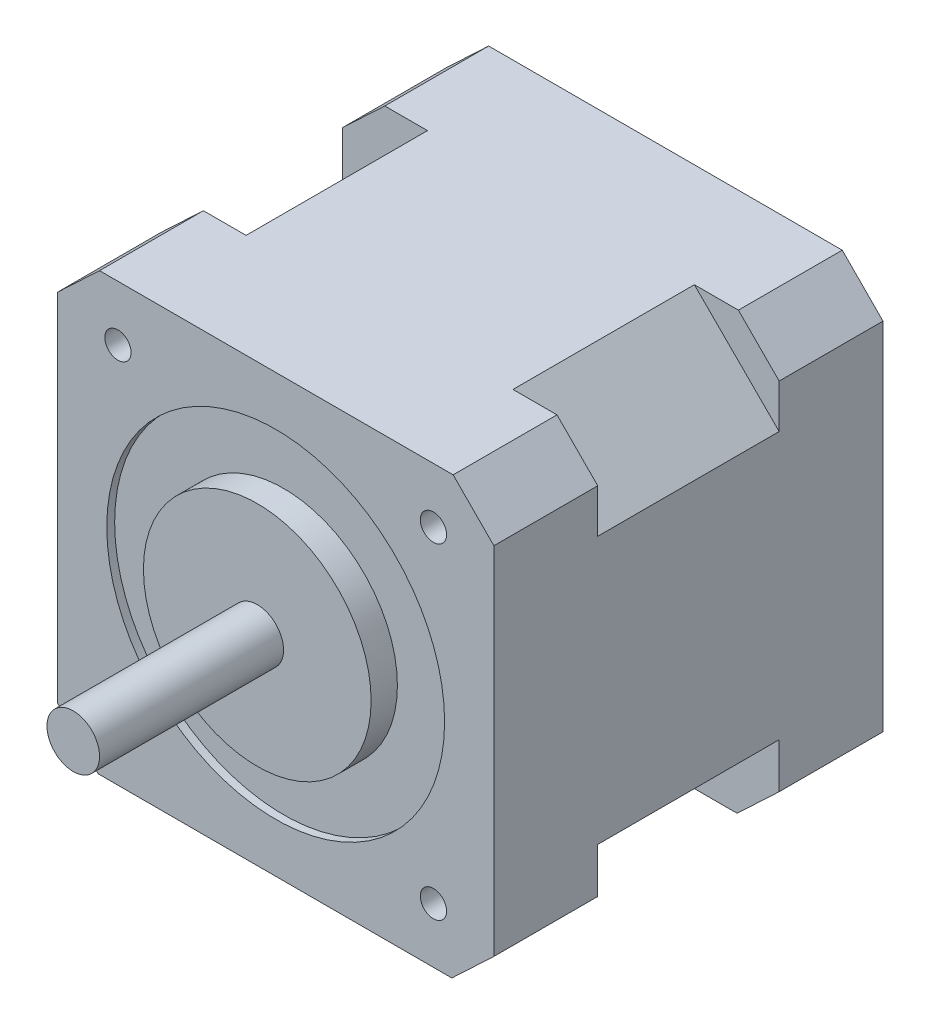
ISO-10303-21;
HEADER;
FILE_DESCRIPTION(('STEP AP214'),'2;1');
FILE_NAME('part.step','',(''),(''),'','','');
FILE_SCHEMA(('AUTOMOTIVE_DESIGN { 1 0 10303 214 1 1 1 1 }'));
ENDSEC;
DATA;
#1=APPLICATION_CONTEXT('core data for automotive mechanical design processes');
#2=APPLICATION_PROTOCOL_DEFINITION('international standard','automotive_design',2000,#1);
#3=PRODUCT_CONTEXT('',#1,'mechanical');
#4=PRODUCT('Part','Part','',(#3));
#5=PRODUCT_RELATED_PRODUCT_CATEGORY('part','',(#4));
#6=PRODUCT_DEFINITION_FORMATION('','',#4);
#7=PRODUCT_DEFINITION_CONTEXT('part definition',#1,'design');
#8=PRODUCT_DEFINITION('design','',#6,#7);
#9=PRODUCT_DEFINITION_SHAPE('','',#8);
#10=(LENGTH_UNIT() NAMED_UNIT(*) SI_UNIT(.MILLI.,.METRE.));
#11=(NAMED_UNIT(*) PLANE_ANGLE_UNIT() SI_UNIT($,.RADIAN.));
#12=(NAMED_UNIT(*) SI_UNIT($,.STERADIAN.) SOLID_ANGLE_UNIT());
#13=UNCERTAINTY_MEASURE_WITH_UNIT(LENGTH_MEASURE(1.E-05),#10,'distance_accuracy_value','');
#14=(GEOMETRIC_REPRESENTATION_CONTEXT(3) GLOBAL_UNCERTAINTY_ASSIGNED_CONTEXT((#13)) GLOBAL_UNIT_ASSIGNED_CONTEXT((#10,
#11,#12)) REPRESENTATION_CONTEXT('',''));
#15=CARTESIAN_POINT('',(0.,0.,0.));
#16=DIRECTION('',(0.,0.,1.));
#17=DIRECTION('',(1.,0.,0.));
#18=AXIS2_PLACEMENT_3D('',#15,#16,#17);
#19=CARTESIAN_POINT('',(0.,0.,-10.033));
#20=DIRECTION('',(0.,0.,-1.));
#21=DIRECTION('',(-1.,0.,0.));
#22=AXIS2_PLACEMENT_3D('',#19,#20,#21);
#23=PLANE('',#22);
#24=DIRECTION('',(0.707106781186547,-0.707106781186548,0.));
#25=VECTOR('',#24,1.);
#26=CARTESIAN_POINT('',(21.082,12.8920064176102,-10.033));
#27=LINE('',#26,#25);
#28=CARTESIAN_POINT('',(12.8920064176102,21.082,-10.033));
#29=VERTEX_POINT('',#28);
#30=CARTESIAN_POINT('',(21.082,12.8920064176102,-10.033));
#31=VERTEX_POINT('',#30);
#32=EDGE_CURVE('E315',#29,#31,#27,.T.);
#33=ORIENTED_EDGE('',*,*,#32,.F.);
#34=DIRECTION('',(-1.,0.,0.));
#35=VECTOR('',#34,1.);
#36=CARTESIAN_POINT('',(-17.018,21.082,-10.033));
#37=LINE('',#36,#35);
#38=CARTESIAN_POINT('',(17.145,21.082,-10.033));
#39=VERTEX_POINT('',#38);
#40=EDGE_CURVE('E337',#39,#29,#37,.T.);
#41=ORIENTED_EDGE('',*,*,#40,.F.);
#42=DIRECTION('',(-0.704545454545454,0.709658863454364,0.));
#43=VECTOR('',#42,1.);
#44=CARTESIAN_POINT('',(17.145,21.082,-10.033));
#45=LINE('',#44,#43);
#46=CARTESIAN_POINT('',(21.082,17.116426271017,-10.033));
#47=VERTEX_POINT('',#46);
#48=EDGE_CURVE('E342',#47,#39,#45,.T.);
#49=ORIENTED_EDGE('',*,*,#48,.F.);
#50=DIRECTION('',(0.,1.,0.));
#51=VECTOR('',#50,1.);
#52=CARTESIAN_POINT('',(21.082,17.116426271017,-10.033));
#53=LINE('',#52,#51);
#54=EDGE_CURVE('E388',#31,#47,#53,.T.);
#55=ORIENTED_EDGE('',*,*,#54,.F.);
#56=EDGE_LOOP('',(#33,#41,#49,#55));
#57=FACE_BOUND('',#56,.T.);
#58=ADVANCED_FACE('F37',(#57),#23,.T.);
#59=DIRECTION('',(0.707106781186548,0.707106781186547,0.));
#60=VECTOR('',#59,1.);
#61=CARTESIAN_POINT('',(-12.8920064176102,21.082,-10.033));
#62=LINE('',#61,#60);
#63=CARTESIAN_POINT('',(-21.082,12.8920064176102,-10.033));
#64=VERTEX_POINT('',#63);
#65=CARTESIAN_POINT('',(-12.8920064176102,21.082,-10.033));
#66=VERTEX_POINT('',#65);
#67=EDGE_CURVE('E321',#64,#66,#62,.T.);
#68=ORIENTED_EDGE('',*,*,#67,.F.);
#69=DIRECTION('',(0.,-1.,0.));
#70=VECTOR('',#69,1.);
#71=CARTESIAN_POINT('',(-21.082,17.2466841068825,-10.033));
#72=LINE('',#71,#70);
#73=CARTESIAN_POINT('',(-21.082,17.2466841068825,-10.033));
#74=VERTEX_POINT('',#73);
#75=EDGE_CURVE('E411',#74,#64,#72,.T.);
#76=ORIENTED_EDGE('',*,*,#75,.F.);
#77=DIRECTION('',(-0.727272727272727,-0.686348585024614,0.));
#78=VECTOR('',#77,1.);
#79=CARTESIAN_POINT('',(-21.082,17.2466841068825,-10.033));
#80=LINE('',#79,#78);
#81=CARTESIAN_POINT('',(-17.018,21.082,-10.033));
#82=VERTEX_POINT('',#81);
#83=EDGE_CURVE('E331',#82,#74,#80,.T.);
#84=ORIENTED_EDGE('',*,*,#83,.F.);
#85=EDGE_CURVE('E334',#66,#82,#37,.T.);
#86=ORIENTED_EDGE('',*,*,#85,.F.);
#87=EDGE_LOOP('',(#68,#76,#84,#86));
#88=FACE_BOUND('',#87,.T.);
#89=ADVANCED_FACE('F430',(#88),#23,.T.);
#90=DIRECTION('',(-0.707106781186548,0.707106781186548,0.));
#91=VECTOR('',#90,1.);
#92=CARTESIAN_POINT('',(-21.082,-12.8920064176102,-10.033));
#93=LINE('',#92,#91);
#94=CARTESIAN_POINT('',(-12.8920064176102,-21.082,-10.033));
#95=VERTEX_POINT('',#94);
#96=CARTESIAN_POINT('',(-21.082,-12.8920064176102,-10.033));
#97=VERTEX_POINT('',#96);
#98=EDGE_CURVE('E294',#95,#97,#93,.T.);
#99=ORIENTED_EDGE('',*,*,#98,.F.);
#100=DIRECTION('',(1.,0.,0.));
#101=VECTOR('',#100,1.);
#102=CARTESIAN_POINT('',(-17.145,-21.082,-10.033));
#103=LINE('',#102,#101);
#104=CARTESIAN_POINT('',(-17.145,-21.082,-10.033));
#105=VERTEX_POINT('',#104);
#106=EDGE_CURVE('E396',#105,#95,#103,.T.);
#107=ORIENTED_EDGE('',*,*,#106,.F.);
#108=DIRECTION('',(0.704545454545455,-0.709658863454363,0.));
#109=VECTOR('',#108,1.);
#110=CARTESIAN_POINT('',(-21.082,-17.116426271017,-10.033));
#111=LINE('',#110,#109);
#112=CARTESIAN_POINT('',(-21.082,-17.116426271017,-10.033));
#113=VERTEX_POINT('',#112);
#114=EDGE_CURVE('E405',#113,#105,#111,.T.);
#115=ORIENTED_EDGE('',*,*,#114,.F.);
#116=EDGE_CURVE('E295',#97,#113,#72,.T.);
#117=ORIENTED_EDGE('',*,*,#116,.F.);
#118=EDGE_LOOP('',(#99,#107,#115,#117));
#119=FACE_BOUND('',#118,.T.);
#120=ADVANCED_FACE('F445',(#119),#23,.T.);
#121=CARTESIAN_POINT('',(-17.018,21.082,-10.033));
#122=DIRECTION('',(0.,1.,0.));
#123=DIRECTION('',(0.,0.,1.));
#124=AXIS2_PLACEMENT_3D('',#121,#122,#123);
#125=PLANE('',#124);
#126=DIRECTION('',(0.,0.,1.));
#127=VECTOR('',#126,1.);
#128=CARTESIAN_POINT('',(12.8920064176102,21.082,-28.067));
#129=LINE('',#128,#127);
#130=CARTESIAN_POINT('',(12.8920064176102,21.082,-27.559));
#131=VERTEX_POINT('',#130);
#132=EDGE_CURVE('E223',#131,#29,#129,.T.);
#133=ORIENTED_EDGE('',*,*,#132,.F.);
#134=DIRECTION('',(-1.,0.,0.));
#135=VECTOR('',#134,1.);
#136=CARTESIAN_POINT('',(-17.018,21.082,-27.559));
#137=LINE('',#136,#135);
#138=CARTESIAN_POINT('',(17.145,21.082,-27.559));
#139=VERTEX_POINT('',#138);
#140=EDGE_CURVE('E203',#139,#131,#137,.T.);
#141=ORIENTED_EDGE('',*,*,#140,.F.);
#142=DIRECTION('',(0.,0.,-1.));
#143=VECTOR('',#142,1.);
#144=CARTESIAN_POINT('',(17.145,21.082,-27.559));
#145=LINE('',#144,#143);
#146=CARTESIAN_POINT('',(17.145,21.082,-37.592));
#147=VERTEX_POINT('',#146);
#148=EDGE_CURVE('E211',#139,#147,#145,.T.);
#149=ORIENTED_EDGE('',*,*,#148,.T.);
#150=DIRECTION('',(-1.,0.,0.));
#151=VECTOR('',#150,1.);
#152=CARTESIAN_POINT('',(-17.018,21.082,-37.592));
#153=LINE('',#152,#151);
#154=CARTESIAN_POINT('',(-17.018,21.082,-37.592));
#155=VERTEX_POINT('',#154);
#156=EDGE_CURVE('E247',#147,#155,#153,.T.);
#157=ORIENTED_EDGE('',*,*,#156,.T.);
#158=DIRECTION('',(0.,0.,-1.));
#159=VECTOR('',#158,1.);
#160=CARTESIAN_POINT('',(-17.018,21.082,-27.559));
#161=LINE('',#160,#159);
#162=CARTESIAN_POINT('',(-17.018,21.082,-27.559));
#163=VERTEX_POINT('',#162);
#164=EDGE_CURVE('E262',#163,#155,#161,.T.);
#165=ORIENTED_EDGE('',*,*,#164,.F.);
#166=CARTESIAN_POINT('',(-12.8920064176102,21.082,-27.559));
#167=VERTEX_POINT('',#166);
#168=EDGE_CURVE('E224',#167,#163,#137,.T.);
#169=ORIENTED_EDGE('',*,*,#168,.F.);
#170=DIRECTION('',(0.,0.,1.));
#171=VECTOR('',#170,1.);
#172=CARTESIAN_POINT('',(-12.8920064176102,21.082,-28.067));
#173=LINE('',#172,#171);
#174=EDGE_CURVE('E433',#167,#66,#173,.T.);
#175=ORIENTED_EDGE('',*,*,#174,.T.);
#176=ORIENTED_EDGE('',*,*,#85,.T.);
#177=DIRECTION('',(0.,0.,1.));
#178=VECTOR('',#177,1.);
#179=CARTESIAN_POINT('',(-17.018,21.082,-10.033));
#180=LINE('',#179,#178);
#181=CARTESIAN_POINT('',(-17.018,21.082,0.));
#182=VERTEX_POINT('',#181);
#183=EDGE_CURVE('E339',#82,#182,#180,.T.);
#184=ORIENTED_EDGE('',*,*,#183,.T.);
#185=DIRECTION('',(-1.,0.,0.));
#186=VECTOR('',#185,1.);
#187=CARTESIAN_POINT('',(-17.018,21.082,0.));
#188=LINE('',#187,#186);
#189=CARTESIAN_POINT('',(17.145,21.082,0.));
#190=VERTEX_POINT('',#189);
#191=EDGE_CURVE('E376',#190,#182,#188,.T.);
#192=ORIENTED_EDGE('',*,*,#191,.F.);
#193=DIRECTION('',(0.,0.,1.));
#194=VECTOR('',#193,1.);
#195=CARTESIAN_POINT('',(17.145,21.082,-10.033));
#196=LINE('',#195,#194);
#197=EDGE_CURVE('E47',#39,#190,#196,.T.);
#198=ORIENTED_EDGE('',*,*,#197,.F.);
#199=ORIENTED_EDGE('',*,*,#40,.T.);
#200=EDGE_LOOP('',(#133,#141,#149,#157,#165,#169,#175,#176,#184,#192,#198,#199));
#201=FACE_BOUND('',#200,.T.);
#202=ADVANCED_FACE('F39',(#201),#125,.T.);
#203=CARTESIAN_POINT('',(17.145,21.082,-10.033));
#204=DIRECTION('',(0.709658863454364,0.704545454545454,0.));
#205=DIRECTION('',(-0.704545454545454,0.709658863454364,0.));
#206=AXIS2_PLACEMENT_3D('',#203,#204,#205);
#207=PLANE('',#206);
#208=DIRECTION('',(-0.704545454545454,0.709658863454364,0.));
#209=VECTOR('',#208,1.);
#210=CARTESIAN_POINT('',(17.145,21.082,0.));
#211=LINE('',#210,#209);
#212=CARTESIAN_POINT('',(21.082,17.116426271017,0.));
#213=VERTEX_POINT('',#212);
#214=EDGE_CURVE('E355',#213,#190,#211,.T.);
#215=ORIENTED_EDGE('',*,*,#214,.F.);
#216=DIRECTION('',(0.,0.,1.));
#217=VECTOR('',#216,1.);
#218=CARTESIAN_POINT('',(21.082,17.116426271017,-10.033));
#219=LINE('',#218,#217);
#220=EDGE_CURVE('E352',#47,#213,#219,.T.);
#221=ORIENTED_EDGE('',*,*,#220,.F.);
#222=ORIENTED_EDGE('',*,*,#48,.T.);
#223=ORIENTED_EDGE('',*,*,#197,.T.);
#224=EDGE_LOOP('',(#215,#221,#222,#223));
#225=FACE_BOUND('',#224,.T.);
#226=ADVANCED_FACE('F516',(#225),#207,.T.);
#227=CARTESIAN_POINT('',(21.082,17.116426271017,-10.033));
#228=DIRECTION('',(1.,0.,0.));
#229=DIRECTION('',(0.,1.,0.));
#230=AXIS2_PLACEMENT_3D('',#227,#228,#229);
#231=PLANE('',#230);
#232=DIRECTION('',(0.,0.,1.));
#233=VECTOR('',#232,1.);
#234=CARTESIAN_POINT('',(21.082,-12.8920064176102,-28.067));
#235=LINE('',#234,#233);
#236=CARTESIAN_POINT('',(21.082,-12.8920064176102,-27.559));
#237=VERTEX_POINT('',#236);
#238=CARTESIAN_POINT('',(21.082,-12.8920064176102,-10.033));
#239=VERTEX_POINT('',#238);
#240=EDGE_CURVE('E41',#237,#239,#235,.T.);
#241=ORIENTED_EDGE('',*,*,#240,.F.);
#242=DIRECTION('',(0.,1.,0.));
#243=VECTOR('',#242,1.);
#244=CARTESIAN_POINT('',(21.082,17.116426271017,-27.559));
#245=LINE('',#244,#243);
#246=CARTESIAN_POINT('',(21.082,-17.2466841068825,-27.559));
#247=VERTEX_POINT('',#246);
#248=EDGE_CURVE('E231',#247,#237,#245,.T.);
#249=ORIENTED_EDGE('',*,*,#248,.F.);
#250=DIRECTION('',(0.,0.,-1.));
#251=VECTOR('',#250,1.);
#252=CARTESIAN_POINT('',(21.082,-17.2466841068825,-27.559));
#253=LINE('',#252,#251);
#254=CARTESIAN_POINT('',(21.082,-17.2466841068825,-37.592));
#255=VERTEX_POINT('',#254);
#256=EDGE_CURVE('E278',#247,#255,#253,.T.);
#257=ORIENTED_EDGE('',*,*,#256,.T.);
#258=DIRECTION('',(0.,1.,0.));
#259=VECTOR('',#258,1.);
#260=CARTESIAN_POINT('',(21.082,17.116426271017,-37.592));
#261=LINE('',#260,#259);
#262=CARTESIAN_POINT('',(21.082,17.116426271017,-37.592));
#263=VERTEX_POINT('',#262);
#264=EDGE_CURVE('E251',#255,#263,#261,.T.);
#265=ORIENTED_EDGE('',*,*,#264,.T.);
#266=DIRECTION('',(0.,0.,-1.));
#267=VECTOR('',#266,1.);
#268=CARTESIAN_POINT('',(21.082,17.116426271017,-27.559));
#269=LINE('',#268,#267);
#270=CARTESIAN_POINT('',(21.082,17.116426271017,-27.559));
#271=VERTEX_POINT('',#270);
#272=EDGE_CURVE('E218',#271,#263,#269,.T.);
#273=ORIENTED_EDGE('',*,*,#272,.F.);
#274=CARTESIAN_POINT('',(21.082,12.8920064176102,-27.559));
#275=VERTEX_POINT('',#274);
#276=EDGE_CURVE('E205',#275,#271,#245,.T.);
#277=ORIENTED_EDGE('',*,*,#276,.F.);
#278=DIRECTION('',(0.,0.,1.));
#279=VECTOR('',#278,1.);
#280=CARTESIAN_POINT('',(21.082,12.8920064176102,-28.067));
#281=LINE('',#280,#279);
#282=EDGE_CURVE('E312',#275,#31,#281,.T.);
#283=ORIENTED_EDGE('',*,*,#282,.T.);
#284=ORIENTED_EDGE('',*,*,#54,.T.);
#285=ORIENTED_EDGE('',*,*,#220,.T.);
#286=DIRECTION('',(0.,1.,0.));
#287=VECTOR('',#286,1.);
#288=CARTESIAN_POINT('',(21.082,17.116426271017,0.));
#289=LINE('',#288,#287);
#290=CARTESIAN_POINT('',(21.082,-17.2466841068825,0.));
#291=VERTEX_POINT('',#290);
#292=EDGE_CURVE('E358',#291,#213,#289,.T.);
#293=ORIENTED_EDGE('',*,*,#292,.F.);
#294=DIRECTION('',(0.,0.,1.));
#295=VECTOR('',#294,1.);
#296=CARTESIAN_POINT('',(21.082,-17.2466841068825,-10.033));
#297=LINE('',#296,#295);
#298=CARTESIAN_POINT('',(21.082,-17.2466841068825,-10.033));
#299=VERTEX_POINT('',#298);
#300=EDGE_CURVE('E350',#299,#291,#297,.T.);
#301=ORIENTED_EDGE('',*,*,#300,.F.);
#302=EDGE_CURVE('E381',#299,#239,#53,.T.);
#303=ORIENTED_EDGE('',*,*,#302,.T.);
#304=EDGE_LOOP('',(#241,#249,#257,#265,#273,#277,#283,#284,#285,#293,#301,#303));
#305=FACE_BOUND('',#304,.T.);
#306=ADVANCED_FACE('F520',(#305),#231,.T.);
#307=CARTESIAN_POINT('',(17.018,-21.082,-10.033));
#308=DIRECTION('',(0.686348585024614,-0.727272727272727,0.));
#309=DIRECTION('',(0.727272727272727,0.686348585024614,0.));
#310=AXIS2_PLACEMENT_3D('',#307,#308,#309);
#311=PLANE('',#310);
#312=DIRECTION('',(0.727272727272727,0.686348585024614,0.));
#313=VECTOR('',#312,1.);
#314=CARTESIAN_POINT('',(17.018,-21.082,0.));
#315=LINE('',#314,#313);
#316=CARTESIAN_POINT('',(17.018,-21.082,0.));
#317=VERTEX_POINT('',#316);
#318=EDGE_CURVE('E361',#317,#291,#315,.T.);
#319=ORIENTED_EDGE('',*,*,#318,.F.);
#320=DIRECTION('',(0.,0.,1.));
#321=VECTOR('',#320,1.);
#322=CARTESIAN_POINT('',(17.018,-21.082,-10.033));
#323=LINE('',#322,#321);
#324=CARTESIAN_POINT('',(17.018,-21.082,-10.033));
#325=VERTEX_POINT('',#324);
#326=EDGE_CURVE('E348',#325,#317,#323,.T.);
#327=ORIENTED_EDGE('',*,*,#326,.F.);
#328=DIRECTION('',(0.727272727272727,0.686348585024614,0.));
#329=VECTOR('',#328,1.);
#330=CARTESIAN_POINT('',(17.018,-21.082,-10.033));
#331=LINE('',#330,#329);
#332=EDGE_CURVE('E384',#325,#299,#331,.T.);
#333=ORIENTED_EDGE('',*,*,#332,.T.);
#334=ORIENTED_EDGE('',*,*,#300,.T.);
#335=EDGE_LOOP('',(#319,#327,#333,#334));
#336=FACE_BOUND('',#335,.T.);
#337=ADVANCED_FACE('F526',(#336),#311,.T.);
#338=CARTESIAN_POINT('',(-17.145,-21.082,-10.033));
#339=DIRECTION('',(0.,-1.,0.));
#340=DIRECTION('',(1.,0.,0.));
#341=AXIS2_PLACEMENT_3D('',#338,#339,#340);
#342=PLANE('',#341);
#343=DIRECTION('',(0.,0.,1.));
#344=VECTOR('',#343,1.);
#345=CARTESIAN_POINT('',(-12.8920064176102,-21.082,-28.067));
#346=LINE('',#345,#344);
#347=CARTESIAN_POINT('',(-12.8920064176102,-21.082,-27.559));
#348=VERTEX_POINT('',#347);
#349=EDGE_CURVE('E302',#348,#95,#346,.T.);
#350=ORIENTED_EDGE('',*,*,#349,.F.);
#351=DIRECTION('',(1.,0.,0.));
#352=VECTOR('',#351,1.);
#353=CARTESIAN_POINT('',(-17.145,-21.082,-27.559));
#354=LINE('',#353,#352);
#355=CARTESIAN_POINT('',(-17.145,-21.082,-27.559));
#356=VERTEX_POINT('',#355);
#357=EDGE_CURVE('E237',#356,#348,#354,.T.);
#358=ORIENTED_EDGE('',*,*,#357,.F.);
#359=DIRECTION('',(0.,0.,-1.));
#360=VECTOR('',#359,1.);
#361=CARTESIAN_POINT('',(-17.145,-21.082,-27.559));
#362=LINE('',#361,#360);
#363=CARTESIAN_POINT('',(-17.145,-21.082,-37.592));
#364=VERTEX_POINT('',#363);
#365=EDGE_CURVE('E272',#356,#364,#362,.T.);
#366=ORIENTED_EDGE('',*,*,#365,.T.);
#367=DIRECTION('',(1.,0.,0.));
#368=VECTOR('',#367,1.);
#369=CARTESIAN_POINT('',(-17.145,-21.082,-37.592));
#370=LINE('',#369,#368);
#371=CARTESIAN_POINT('',(17.018,-21.082,-37.592));
#372=VERTEX_POINT('',#371);
#373=EDGE_CURVE('E255',#364,#372,#370,.T.);
#374=ORIENTED_EDGE('',*,*,#373,.T.);
#375=DIRECTION('',(0.,0.,-1.));
#376=VECTOR('',#375,1.);
#377=CARTESIAN_POINT('',(17.018,-21.082,-27.559));
#378=LINE('',#377,#376);
#379=CARTESIAN_POINT('',(17.018,-21.082,-27.559));
#380=VERTEX_POINT('',#379);
#381=EDGE_CURVE('E275',#380,#372,#378,.T.);
#382=ORIENTED_EDGE('',*,*,#381,.F.);
#383=CARTESIAN_POINT('',(12.8920064176102,-21.082,-27.559));
#384=VERTEX_POINT('',#383);
#385=EDGE_CURVE('E236',#384,#380,#354,.T.);
#386=ORIENTED_EDGE('',*,*,#385,.F.);
#387=DIRECTION('',(0.,0.,1.));
#388=VECTOR('',#387,1.);
#389=CARTESIAN_POINT('',(12.8920064176102,-21.082,-28.067));
#390=LINE('',#389,#388);
#391=CARTESIAN_POINT('',(12.8920064176102,-21.082,-10.033));
#392=VERTEX_POINT('',#391);
#393=EDGE_CURVE('E60',#384,#392,#390,.T.);
#394=ORIENTED_EDGE('',*,*,#393,.T.);
#395=EDGE_CURVE('E401',#392,#325,#103,.T.);
#396=ORIENTED_EDGE('',*,*,#395,.T.);
#397=ORIENTED_EDGE('',*,*,#326,.T.);
#398=DIRECTION('',(1.,0.,0.));
#399=VECTOR('',#398,1.);
#400=CARTESIAN_POINT('',(-17.145,-21.082,0.));
#401=LINE('',#400,#399);
#402=CARTESIAN_POINT('',(-17.145,-21.082,0.));
#403=VERTEX_POINT('',#402);
#404=EDGE_CURVE('E364',#403,#317,#401,.T.);
#405=ORIENTED_EDGE('',*,*,#404,.F.);
#406=DIRECTION('',(0.,0.,1.));
#407=VECTOR('',#406,1.);
#408=CARTESIAN_POINT('',(-17.145,-21.082,-10.033));
#409=LINE('',#408,#407);
#410=EDGE_CURVE('E346',#105,#403,#409,.T.);
#411=ORIENTED_EDGE('',*,*,#410,.F.);
#412=ORIENTED_EDGE('',*,*,#106,.T.);
#413=EDGE_LOOP('',(#350,#358,#366,#374,#382,#386,#394,#396,#397,#405,#411,#412));
#414=FACE_BOUND('',#413,.T.);
#415=ADVANCED_FACE('F477',(#414),#342,.T.);
#416=CARTESIAN_POINT('',(-21.082,-17.116426271017,-10.033));
#417=DIRECTION('',(-0.709658863454363,-0.704545454545455,0.));
#418=DIRECTION('',(0.704545454545455,-0.709658863454363,0.));
#419=AXIS2_PLACEMENT_3D('',#416,#417,#418);
#420=PLANE('',#419);
#421=DIRECTION('',(0.704545454545455,-0.709658863454363,0.));
#422=VECTOR('',#421,1.);
#423=CARTESIAN_POINT('',(-21.082,-17.116426271017,0.));
#424=LINE('',#423,#422);
#425=CARTESIAN_POINT('',(-21.082,-17.116426271017,0.));
#426=VERTEX_POINT('',#425);
#427=EDGE_CURVE('E367',#426,#403,#424,.T.);
#428=ORIENTED_EDGE('',*,*,#427,.F.);
#429=DIRECTION('',(0.,0.,1.));
#430=VECTOR('',#429,1.);
#431=CARTESIAN_POINT('',(-21.082,-17.116426271017,-10.033));
#432=LINE('',#431,#430);
#433=EDGE_CURVE('E344',#113,#426,#432,.T.);
#434=ORIENTED_EDGE('',*,*,#433,.F.);
#435=ORIENTED_EDGE('',*,*,#114,.T.);
#436=ORIENTED_EDGE('',*,*,#410,.T.);
#437=EDGE_LOOP('',(#428,#434,#435,#436));
#438=FACE_BOUND('',#437,.T.);
#439=ADVANCED_FACE('F449',(#438),#420,.T.);
#440=CARTESIAN_POINT('',(-21.082,17.2466841068825,-10.033));
#441=DIRECTION('',(-1.,0.,0.));
#442=DIRECTION('',(0.,0.,1.));
#443=AXIS2_PLACEMENT_3D('',#440,#441,#442);
#444=PLANE('',#443);
#445=DIRECTION('',(0.,0.,1.));
#446=VECTOR('',#445,1.);
#447=CARTESIAN_POINT('',(-21.082,12.8920064176102,-28.067));
#448=LINE('',#447,#446);
#449=CARTESIAN_POINT('',(-21.082,12.8920064176102,-27.559));
#450=VERTEX_POINT('',#449);
#451=EDGE_CURVE('E435',#450,#64,#448,.T.);
#452=ORIENTED_EDGE('',*,*,#451,.F.);
#453=DIRECTION('',(0.,-1.,0.));
#454=VECTOR('',#453,1.);
#455=CARTESIAN_POINT('',(-21.082,17.2466841068825,-27.559));
#456=LINE('',#455,#454);
#457=CARTESIAN_POINT('',(-21.082,17.2466841068825,-27.559));
#458=VERTEX_POINT('',#457);
#459=EDGE_CURVE('E243',#458,#450,#456,.T.);
#460=ORIENTED_EDGE('',*,*,#459,.F.);
#461=DIRECTION('',(0.,0.,-1.));
#462=VECTOR('',#461,1.);
#463=CARTESIAN_POINT('',(-21.082,17.2466841068825,-27.559));
#464=LINE('',#463,#462);
#465=CARTESIAN_POINT('',(-21.082,17.2466841068825,-37.592));
#466=VERTEX_POINT('',#465);
#467=EDGE_CURVE('E266',#458,#466,#464,.T.);
#468=ORIENTED_EDGE('',*,*,#467,.T.);
#469=DIRECTION('',(0.,-1.,0.));
#470=VECTOR('',#469,1.);
#471=CARTESIAN_POINT('',(-21.082,17.2466841068825,-37.592));
#472=LINE('',#471,#470);
#473=CARTESIAN_POINT('',(-21.082,-17.116426271017,-37.592));
#474=VERTEX_POINT('',#473);
#475=EDGE_CURVE('E259',#466,#474,#472,.T.);
#476=ORIENTED_EDGE('',*,*,#475,.T.);
#477=DIRECTION('',(0.,0.,-1.));
#478=VECTOR('',#477,1.);
#479=CARTESIAN_POINT('',(-21.082,-17.116426271017,-27.559));
#480=LINE('',#479,#478);
#481=CARTESIAN_POINT('',(-21.082,-17.116426271017,-27.559));
#482=VERTEX_POINT('',#481);
#483=EDGE_CURVE('E269',#482,#474,#480,.T.);
#484=ORIENTED_EDGE('',*,*,#483,.F.);
#485=CARTESIAN_POINT('',(-21.082,-12.8920064176102,-27.559));
#486=VERTEX_POINT('',#485);
#487=EDGE_CURVE('E242',#486,#482,#456,.T.);
#488=ORIENTED_EDGE('',*,*,#487,.F.);
#489=DIRECTION('',(0.,0.,1.));
#490=VECTOR('',#489,1.);
#491=CARTESIAN_POINT('',(-21.082,-12.8920064176102,-28.067));
#492=LINE('',#491,#490);
#493=EDGE_CURVE('E305',#486,#97,#492,.T.);
#494=ORIENTED_EDGE('',*,*,#493,.T.);
#495=ORIENTED_EDGE('',*,*,#116,.T.);
#496=ORIENTED_EDGE('',*,*,#433,.T.);
#497=DIRECTION('',(0.,-1.,0.));
#498=VECTOR('',#497,1.);
#499=CARTESIAN_POINT('',(-21.082,17.2466841068825,0.));
#500=LINE('',#499,#498);
#501=CARTESIAN_POINT('',(-21.082,17.2466841068825,0.));
#502=VERTEX_POINT('',#501);
#503=EDGE_CURVE('E370',#502,#426,#500,.T.);
#504=ORIENTED_EDGE('',*,*,#503,.F.);
#505=DIRECTION('',(0.,0.,1.));
#506=VECTOR('',#505,1.);
#507=CARTESIAN_POINT('',(-21.082,17.2466841068825,-10.033));
#508=LINE('',#507,#506);
#509=EDGE_CURVE('E341',#74,#502,#508,.T.);
#510=ORIENTED_EDGE('',*,*,#509,.F.);
#511=ORIENTED_EDGE('',*,*,#75,.T.);
#512=EDGE_LOOP('',(#452,#460,#468,#476,#484,#488,#494,#495,#496,#504,#510,#511));
#513=FACE_BOUND('',#512,.T.);
#514=ADVANCED_FACE('F451',(#513),#444,.T.);
#515=CARTESIAN_POINT('',(-21.082,17.2466841068825,-10.033));
#516=DIRECTION('',(-0.686348585024614,0.727272727272727,0.));
#517=DIRECTION('',(-0.727272727272727,-0.686348585024614,0.));
#518=AXIS2_PLACEMENT_3D('',#515,#516,#517);
#519=PLANE('',#518);
#520=DIRECTION('',(-0.727272727272727,-0.686348585024614,0.));
#521=VECTOR('',#520,1.);
#522=CARTESIAN_POINT('',(-21.082,17.2466841068825,0.));
#523=LINE('',#522,#521);
#524=EDGE_CURVE('E373',#182,#502,#523,.T.);
#525=ORIENTED_EDGE('',*,*,#524,.F.);
#526=ORIENTED_EDGE('',*,*,#183,.F.);
#527=ORIENTED_EDGE('',*,*,#83,.T.);
#528=ORIENTED_EDGE('',*,*,#509,.T.);
#529=EDGE_LOOP('',(#525,#526,#527,#528));
#530=FACE_BOUND('',#529,.T.);
#531=ADVANCED_FACE('F425',(#530),#519,.T.);
#532=DIRECTION('',(-0.707106781186547,-0.707106781186548,0.));
#533=VECTOR('',#532,1.);
#534=CARTESIAN_POINT('',(12.8920064176102,-21.082,-10.033));
#535=LINE('',#534,#533);
#536=EDGE_CURVE('E286',#239,#392,#535,.T.);
#537=ORIENTED_EDGE('',*,*,#536,.F.);
#538=ORIENTED_EDGE('',*,*,#302,.F.);
#539=ORIENTED_EDGE('',*,*,#332,.F.);
#540=ORIENTED_EDGE('',*,*,#395,.F.);
#541=EDGE_LOOP('',(#537,#538,#539,#540));
#542=FACE_BOUND('',#541,.T.);
#543=ADVANCED_FACE('F496',(#542),#23,.T.);
#544=CARTESIAN_POINT('',(0.,0.,0.));
#545=DIRECTION('',(0.,0.,-1.));
#546=DIRECTION('',(-1.,0.,0.));
#547=AXIS2_PLACEMENT_3D('',#544,#545,#546);
#548=PLANE('',#547);
#549=CARTESIAN_POINT('',(15.24,-15.748,0.));
#550=DIRECTION('',(0.,0.,-1.));
#551=DIRECTION('',(1.,0.,0.));
#552=AXIS2_PLACEMENT_3D('',#549,#550,#551);
#553=CIRCLE('',#552,1.27);
#554=CARTESIAN_POINT('',(16.51,-15.748,0.));
#555=VERTEX_POINT('',#554);
#556=EDGE_CURVE('E873',#555,#555,#553,.T.);
#557=ORIENTED_EDGE('',*,*,#556,.T.);
#558=EDGE_LOOP('',(#557));
#559=FACE_BOUND('',#558,.T.);
#560=CARTESIAN_POINT('',(-15.24,-15.748,0.));
#561=DIRECTION('',(0.,0.,-1.));
#562=DIRECTION('',(1.,0.,0.));
#563=AXIS2_PLACEMENT_3D('',#560,#561,#562);
#564=CIRCLE('',#563,1.27);
#565=CARTESIAN_POINT('',(-13.97,-15.748,0.));
#566=VERTEX_POINT('',#565);
#567=EDGE_CURVE('E872',#566,#566,#564,.T.);
#568=ORIENTED_EDGE('',*,*,#567,.T.);
#569=EDGE_LOOP('',(#568));
#570=FACE_BOUND('',#569,.T.);
#571=CARTESIAN_POINT('',(15.24,15.748,0.));
#572=DIRECTION('',(0.,0.,1.));
#573=DIRECTION('',(1.,0.,0.));
#574=AXIS2_PLACEMENT_3D('',#571,#572,#573);
#575=CIRCLE('',#574,1.27);
#576=CARTESIAN_POINT('',(16.51,15.748,0.));
#577=VERTEX_POINT('',#576);
#578=EDGE_CURVE('E882',#577,#577,#575,.T.);
#579=ORIENTED_EDGE('',*,*,#578,.F.);
#580=EDGE_LOOP('',(#579));
#581=FACE_BOUND('',#580,.T.);
#582=CARTESIAN_POINT('',(-15.24,15.748,0.));
#583=DIRECTION('',(0.,0.,1.));
#584=DIRECTION('',(1.,0.,0.));
#585=AXIS2_PLACEMENT_3D('',#582,#583,#584);
#586=CIRCLE('',#585,1.27);
#587=CARTESIAN_POINT('',(-13.97,15.748,0.));
#588=VERTEX_POINT('',#587);
#589=EDGE_CURVE('E887',#588,#588,#586,.T.);
#590=ORIENTED_EDGE('',*,*,#589,.F.);
#591=EDGE_LOOP('',(#590));
#592=FACE_BOUND('',#591,.T.);
#593=CARTESIAN_POINT('',(0.,0.,0.));
#594=DIRECTION('',(0.,0.,1.));
#595=DIRECTION('',(1.,0.,0.));
#596=AXIS2_PLACEMENT_3D('',#593,#594,#595);
#597=CIRCLE('',#596,16.3195);
#598=CARTESIAN_POINT('',(16.3195,0.,0.));
#599=VERTEX_POINT('',#598);
#600=EDGE_CURVE('E228',#599,#599,#597,.T.);
#601=ORIENTED_EDGE('',*,*,#600,.F.);
#602=EDGE_LOOP('',(#601));
#603=FACE_BOUND('',#602,.T.);
#604=ORIENTED_EDGE('',*,*,#191,.T.);
#605=ORIENTED_EDGE('',*,*,#524,.T.);
#606=ORIENTED_EDGE('',*,*,#503,.T.);
#607=ORIENTED_EDGE('',*,*,#427,.T.);
#608=ORIENTED_EDGE('',*,*,#404,.T.);
#609=ORIENTED_EDGE('',*,*,#318,.T.);
#610=ORIENTED_EDGE('',*,*,#292,.T.);
#611=ORIENTED_EDGE('',*,*,#214,.T.);
#612=EDGE_LOOP('',(#604,#605,#606,#607,#608,#609,#610,#611));
#613=FACE_BOUND('',#612,.T.);
#614=ADVANCED_FACE('F453',(#559,#570,#581,#592,#603,#613),#548,.F.);
#615=CARTESIAN_POINT('',(12.8920064176102,-21.082,-28.067));
#616=DIRECTION('',(-0.707106781186548,0.707106781186547,0.));
#617=DIRECTION('',(-0.707106781186547,-0.707106781186548,0.));
#618=AXIS2_PLACEMENT_3D('',#615,#616,#617);
#619=PLANE('',#618);
#620=ORIENTED_EDGE('',*,*,#393,.F.);
#621=DIRECTION('',(0.707106781186547,0.707106781186548,0.));
#622=VECTOR('',#621,1.);
#623=CARTESIAN_POINT('',(12.8920064176102,-21.082,-27.559));
#624=LINE('',#623,#622);
#625=EDGE_CURVE('E55',#384,#237,#624,.T.);
#626=ORIENTED_EDGE('',*,*,#625,.T.);
#627=ORIENTED_EDGE('',*,*,#240,.T.);
#628=ORIENTED_EDGE('',*,*,#536,.T.);
#629=EDGE_LOOP('',(#620,#626,#627,#628));
#630=FACE_BOUND('',#629,.T.);
#631=ADVANCED_FACE('F509',(#630),#619,.F.);
#632=CARTESIAN_POINT('',(-21.082,-12.8920064176102,-28.067));
#633=DIRECTION('',(0.707106781186547,0.707106781186548,0.));
#634=DIRECTION('',(-0.707106781186548,0.707106781186547,0.));
#635=AXIS2_PLACEMENT_3D('',#632,#633,#634);
#636=PLANE('',#635);
#637=ORIENTED_EDGE('',*,*,#493,.F.);
#638=DIRECTION('',(0.707106781186548,-0.707106781186547,0.));
#639=VECTOR('',#638,1.);
#640=CARTESIAN_POINT('',(-21.082,-12.8920064176102,-27.559));
#641=LINE('',#640,#639);
#642=EDGE_CURVE('E283',#486,#348,#641,.T.);
#643=ORIENTED_EDGE('',*,*,#642,.T.);
#644=ORIENTED_EDGE('',*,*,#349,.T.);
#645=ORIENTED_EDGE('',*,*,#98,.T.);
#646=EDGE_LOOP('',(#637,#643,#644,#645));
#647=FACE_BOUND('',#646,.T.);
#648=ADVANCED_FACE('F442',(#647),#636,.F.);
#649=CARTESIAN_POINT('',(-12.8920064176102,21.082,-28.067));
#650=DIRECTION('',(0.707106781186547,-0.707106781186548,0.));
#651=DIRECTION('',(0.707106781186548,0.707106781186547,0.));
#652=AXIS2_PLACEMENT_3D('',#649,#650,#651);
#653=PLANE('',#652);
#654=ORIENTED_EDGE('',*,*,#174,.F.);
#655=DIRECTION('',(-0.707106781186548,-0.707106781186547,0.));
#656=VECTOR('',#655,1.);
#657=CARTESIAN_POINT('',(-12.8920064176102,21.082,-27.559));
#658=LINE('',#657,#656);
#659=EDGE_CURVE('E265',#167,#450,#658,.T.);
#660=ORIENTED_EDGE('',*,*,#659,.T.);
#661=ORIENTED_EDGE('',*,*,#451,.T.);
#662=ORIENTED_EDGE('',*,*,#67,.T.);
#663=EDGE_LOOP('',(#654,#660,#661,#662));
#664=FACE_BOUND('',#663,.T.);
#665=ADVANCED_FACE('F432',(#664),#653,.F.);
#666=CARTESIAN_POINT('',(21.082,12.8920064176102,-28.067));
#667=DIRECTION('',(-0.707106781186548,-0.707106781186547,0.));
#668=DIRECTION('',(0.707106781186547,-0.707106781186548,0.));
#669=AXIS2_PLACEMENT_3D('',#666,#667,#668);
#670=PLANE('',#669);
#671=ORIENTED_EDGE('',*,*,#282,.F.);
#672=DIRECTION('',(-0.707106781186547,0.707106781186548,0.));
#673=VECTOR('',#672,1.);
#674=CARTESIAN_POINT('',(21.082,12.8920064176102,-27.559));
#675=LINE('',#674,#673);
#676=EDGE_CURVE('E11',#275,#131,#675,.T.);
#677=ORIENTED_EDGE('',*,*,#676,.T.);
#678=ORIENTED_EDGE('',*,*,#132,.T.);
#679=ORIENTED_EDGE('',*,*,#32,.T.);
#680=EDGE_LOOP('',(#671,#677,#678,#679));
#681=FACE_BOUND('',#680,.T.);
#682=ADVANCED_FACE('F489',(#681),#670,.F.);
#683=CARTESIAN_POINT('',(0.,0.,-27.559));
#684=DIRECTION('',(0.,0.,1.));
#685=DIRECTION('',(-1.,0.,0.));
#686=AXIS2_PLACEMENT_3D('',#683,#684,#685);
#687=PLANE('',#686);
#688=ORIENTED_EDGE('',*,*,#625,.F.);
#689=ORIENTED_EDGE('',*,*,#385,.T.);
#690=DIRECTION('',(0.727272727272727,0.686348585024614,0.));
#691=VECTOR('',#690,1.);
#692=CARTESIAN_POINT('',(17.018,-21.082,-27.559));
#693=LINE('',#692,#691);
#694=EDGE_CURVE('E234',#380,#247,#693,.T.);
#695=ORIENTED_EDGE('',*,*,#694,.T.);
#696=ORIENTED_EDGE('',*,*,#248,.T.);
#697=EDGE_LOOP('',(#688,#689,#695,#696));
#698=FACE_BOUND('',#697,.T.);
#699=ADVANCED_FACE('F483',(#698),#687,.T.);
#700=ORIENTED_EDGE('',*,*,#642,.F.);
#701=ORIENTED_EDGE('',*,*,#487,.T.);
#702=DIRECTION('',(0.704545454545455,-0.709658863454363,0.));
#703=VECTOR('',#702,1.);
#704=CARTESIAN_POINT('',(-21.082,-17.116426271017,-27.559));
#705=LINE('',#704,#703);
#706=EDGE_CURVE('E240',#482,#356,#705,.T.);
#707=ORIENTED_EDGE('',*,*,#706,.T.);
#708=ORIENTED_EDGE('',*,*,#357,.T.);
#709=EDGE_LOOP('',(#700,#701,#707,#708));
#710=FACE_BOUND('',#709,.T.);
#711=ADVANCED_FACE('F480',(#710),#687,.T.);
#712=ORIENTED_EDGE('',*,*,#659,.F.);
#713=ORIENTED_EDGE('',*,*,#168,.T.);
#714=DIRECTION('',(-0.727272727272727,-0.686348585024614,0.));
#715=VECTOR('',#714,1.);
#716=CARTESIAN_POINT('',(-21.082,17.2466841068825,-27.559));
#717=LINE('',#716,#715);
#718=EDGE_CURVE('E219',#163,#458,#717,.T.);
#719=ORIENTED_EDGE('',*,*,#718,.T.);
#720=ORIENTED_EDGE('',*,*,#459,.T.);
#721=EDGE_LOOP('',(#712,#713,#719,#720));
#722=FACE_BOUND('',#721,.T.);
#723=ADVANCED_FACE('F461',(#722),#687,.T.);
#724=ORIENTED_EDGE('',*,*,#676,.F.);
#725=ORIENTED_EDGE('',*,*,#276,.T.);
#726=DIRECTION('',(-0.704545454545454,0.709658863454364,0.));
#727=VECTOR('',#726,1.);
#728=CARTESIAN_POINT('',(17.145,21.082,-27.559));
#729=LINE('',#728,#727);
#730=EDGE_CURVE('E198',#271,#139,#729,.T.);
#731=ORIENTED_EDGE('',*,*,#730,.T.);
#732=ORIENTED_EDGE('',*,*,#140,.T.);
#733=EDGE_LOOP('',(#724,#725,#731,#732));
#734=FACE_BOUND('',#733,.T.);
#735=ADVANCED_FACE('F201',(#734),#687,.T.);
#736=CARTESIAN_POINT('',(-21.082,17.2466841068825,-27.559));
#737=DIRECTION('',(0.686348585024614,-0.727272727272727,0.));
#738=DIRECTION('',(0.727272727272727,0.686348585024614,0.));
#739=AXIS2_PLACEMENT_3D('',#736,#737,#738);
#740=PLANE('',#739);
#741=DIRECTION('',(-0.727272727272727,-0.686348585024614,0.));
#742=VECTOR('',#741,1.);
#743=CARTESIAN_POINT('',(-21.082,17.2466841068825,-37.592));
#744=LINE('',#743,#742);
#745=EDGE_CURVE('E226',#155,#466,#744,.T.);
#746=ORIENTED_EDGE('',*,*,#745,.T.);
#747=ORIENTED_EDGE('',*,*,#467,.F.);
#748=ORIENTED_EDGE('',*,*,#718,.F.);
#749=ORIENTED_EDGE('',*,*,#164,.T.);
#750=EDGE_LOOP('',(#746,#747,#748,#749));
#751=FACE_BOUND('',#750,.T.);
#752=ADVANCED_FACE('F464',(#751),#740,.F.);
#753=CARTESIAN_POINT('',(-21.082,-17.116426271017,-27.559));
#754=DIRECTION('',(0.709658863454363,0.704545454545455,0.));
#755=DIRECTION('',(-0.704545454545455,0.709658863454363,0.));
#756=AXIS2_PLACEMENT_3D('',#753,#754,#755);
#757=PLANE('',#756);
#758=DIRECTION('',(0.704545454545455,-0.709658863454363,0.));
#759=VECTOR('',#758,1.);
#760=CARTESIAN_POINT('',(-21.082,-17.116426271017,-37.592));
#761=LINE('',#760,#759);
#762=EDGE_CURVE('E257',#474,#364,#761,.T.);
#763=ORIENTED_EDGE('',*,*,#762,.T.);
#764=ORIENTED_EDGE('',*,*,#365,.F.);
#765=ORIENTED_EDGE('',*,*,#706,.F.);
#766=ORIENTED_EDGE('',*,*,#483,.T.);
#767=EDGE_LOOP('',(#763,#764,#765,#766));
#768=FACE_BOUND('',#767,.T.);
#769=ADVANCED_FACE('F474',(#768),#757,.F.);
#770=CARTESIAN_POINT('',(17.018,-21.082,-27.559));
#771=DIRECTION('',(-0.686348585024614,0.727272727272727,0.));
#772=DIRECTION('',(-0.727272727272727,-0.686348585024614,0.));
#773=AXIS2_PLACEMENT_3D('',#770,#771,#772);
#774=PLANE('',#773);
#775=DIRECTION('',(0.727272727272727,0.686348585024614,0.));
#776=VECTOR('',#775,1.);
#777=CARTESIAN_POINT('',(17.018,-21.082,-37.592));
#778=LINE('',#777,#776);
#779=EDGE_CURVE('E253',#372,#255,#778,.T.);
#780=ORIENTED_EDGE('',*,*,#779,.T.);
#781=ORIENTED_EDGE('',*,*,#256,.F.);
#782=ORIENTED_EDGE('',*,*,#694,.F.);
#783=ORIENTED_EDGE('',*,*,#381,.T.);
#784=EDGE_LOOP('',(#780,#781,#782,#783));
#785=FACE_BOUND('',#784,.T.);
#786=ADVANCED_FACE('F695',(#785),#774,.F.);
#787=CARTESIAN_POINT('',(17.145,21.082,-27.559));
#788=DIRECTION('',(-0.709658863454364,-0.704545454545454,0.));
#789=DIRECTION('',(0.704545454545454,-0.709658863454364,0.));
#790=AXIS2_PLACEMENT_3D('',#787,#788,#789);
#791=PLANE('',#790);
#792=DIRECTION('',(-0.704545454545454,0.709658863454364,0.));
#793=VECTOR('',#792,1.);
#794=CARTESIAN_POINT('',(17.145,21.082,-37.592));
#795=LINE('',#794,#793);
#796=EDGE_CURVE('E214',#263,#147,#795,.T.);
#797=ORIENTED_EDGE('',*,*,#796,.T.);
#798=ORIENTED_EDGE('',*,*,#148,.F.);
#799=ORIENTED_EDGE('',*,*,#730,.F.);
#800=ORIENTED_EDGE('',*,*,#272,.T.);
#801=EDGE_LOOP('',(#797,#798,#799,#800));
#802=FACE_BOUND('',#801,.T.);
#803=ADVANCED_FACE('F212',(#802),#791,.F.);
#804=CARTESIAN_POINT('',(0.,0.,-37.592));
#805=DIRECTION('',(0.,0.,1.));
#806=DIRECTION('',(-1.,0.,0.));
#807=AXIS2_PLACEMENT_3D('',#804,#805,#806);
#808=PLANE('',#807);
#809=ORIENTED_EDGE('',*,*,#156,.F.);
#810=ORIENTED_EDGE('',*,*,#796,.F.);
#811=ORIENTED_EDGE('',*,*,#264,.F.);
#812=ORIENTED_EDGE('',*,*,#779,.F.);
#813=ORIENTED_EDGE('',*,*,#373,.F.);
#814=ORIENTED_EDGE('',*,*,#762,.F.);
#815=ORIENTED_EDGE('',*,*,#475,.F.);
#816=ORIENTED_EDGE('',*,*,#745,.F.);
#817=EDGE_LOOP('',(#809,#810,#811,#812,#813,#814,#815,#816));
#818=FACE_BOUND('',#817,.T.);
#819=ADVANCED_FACE('F469',(#818),#808,.F.);
#820=CARTESIAN_POINT('',(0.,0.,-0.762));
#821=DIRECTION('',(0.,0.,1.));
#822=DIRECTION('',(1.,0.,0.));
#823=AXIS2_PLACEMENT_3D('',#820,#821,#822);
#824=CYLINDRICAL_SURFACE('',#823,16.3195);
#825=CARTESIAN_POINT('',(0.,0.,-0.762));
#826=DIRECTION('',(0.,0.,1.));
#827=DIRECTION('',(1.,0.,0.));
#828=AXIS2_PLACEMENT_3D('',#825,#826,#827);
#829=CIRCLE('',#828,16.3195);
#830=CARTESIAN_POINT('',(16.3195,0.,-0.762));
#831=VERTEX_POINT('',#830);
#832=EDGE_CURVE('E249',#831,#831,#829,.T.);
#833=ORIENTED_EDGE('',*,*,#832,.F.);
#834=EDGE_LOOP('',(#833));
#835=FACE_BOUND('',#834,.T.);
#836=ORIENTED_EDGE('',*,*,#600,.T.);
#837=EDGE_LOOP('',(#836));
#838=FACE_BOUND('',#837,.T.);
#839=ADVANCED_FACE('F723',(#835,#838),#824,.F.);
#840=CARTESIAN_POINT('',(0.,0.,-0.762));
#841=DIRECTION('',(0.,0.,1.));
#842=DIRECTION('',(1.,0.,0.));
#843=AXIS2_PLACEMENT_3D('',#840,#841,#842);
#844=PLANE('',#843);
#845=CARTESIAN_POINT('',(0.,0.,-0.762));
#846=DIRECTION('',(0.,0.,1.));
#847=DIRECTION('',(1.,0.,0.));
#848=AXIS2_PLACEMENT_3D('',#845,#846,#847);
#849=CIRCLE('',#848,10.9982);
#850=CARTESIAN_POINT('',(10.9982,0.,-0.762));
#851=VERTEX_POINT('',#850);
#852=EDGE_CURVE('E899',#851,#851,#849,.T.);
#853=ORIENTED_EDGE('',*,*,#852,.F.);
#854=EDGE_LOOP('',(#853));
#855=FACE_BOUND('',#854,.T.);
#856=ORIENTED_EDGE('',*,*,#832,.T.);
#857=EDGE_LOOP('',(#856));
#858=FACE_BOUND('',#857,.T.);
#859=ADVANCED_FACE('F731',(#855,#858),#844,.T.);
#860=CARTESIAN_POINT('',(0.,0.,1.778));
#861=DIRECTION('',(0.,0.,-1.));
#862=DIRECTION('',(-1.,0.,0.));
#863=AXIS2_PLACEMENT_3D('',#860,#861,#862);
#864=CYLINDRICAL_SURFACE('',#863,10.9982);
#865=CARTESIAN_POINT('',(0.,0.,1.778));
#866=DIRECTION('',(0.,0.,1.));
#867=DIRECTION('',(1.,0.,0.));
#868=AXIS2_PLACEMENT_3D('',#865,#866,#867);
#869=CIRCLE('',#868,10.9982);
#870=CARTESIAN_POINT('',(10.9982,0.,1.778));
#871=VERTEX_POINT('',#870);
#872=EDGE_CURVE('E902',#871,#871,#869,.T.);
#873=ORIENTED_EDGE('',*,*,#872,.F.);
#874=EDGE_LOOP('',(#873));
#875=FACE_BOUND('',#874,.T.);
#876=ORIENTED_EDGE('',*,*,#852,.T.);
#877=EDGE_LOOP('',(#876));
#878=FACE_BOUND('',#877,.T.);
#879=ADVANCED_FACE('F740',(#875,#878),#864,.T.);
#880=CARTESIAN_POINT('',(0.,0.,1.778));
#881=DIRECTION('',(0.,0.,1.));
#882=DIRECTION('',(1.,0.,0.));
#883=AXIS2_PLACEMENT_3D('',#880,#881,#882);
#884=PLANE('',#883);
#885=CARTESIAN_POINT('',(0.,0.,1.778));
#886=DIRECTION('',(0.,0.,1.));
#887=DIRECTION('',(1.,0.,0.));
#888=AXIS2_PLACEMENT_3D('',#885,#886,#887);
#889=CIRCLE('',#888,2.54);
#890=CARTESIAN_POINT('',(2.54,0.,1.778));
#891=VERTEX_POINT('',#890);
#892=EDGE_CURVE('E893',#891,#891,#889,.T.);
#893=ORIENTED_EDGE('',*,*,#892,.F.);
#894=EDGE_LOOP('',(#893));
#895=FACE_BOUND('',#894,.T.);
#896=ORIENTED_EDGE('',*,*,#872,.T.);
#897=EDGE_LOOP('',(#896));
#898=FACE_BOUND('',#897,.T.);
#899=ADVANCED_FACE('F750',(#895,#898),#884,.T.);
#900=CARTESIAN_POINT('',(0.,0.,19.558));
#901=DIRECTION('',(0.,0.,-1.));
#902=DIRECTION('',(-1.,0.,0.));
#903=AXIS2_PLACEMENT_3D('',#900,#901,#902);
#904=CYLINDRICAL_SURFACE('',#903,2.54);
#905=CARTESIAN_POINT('',(0.,0.,19.558));
#906=DIRECTION('',(0.,0.,1.));
#907=DIRECTION('',(1.,0.,0.));
#908=AXIS2_PLACEMENT_3D('',#905,#906,#907);
#909=CIRCLE('',#908,2.54);
#910=CARTESIAN_POINT('',(2.54,0.,19.558));
#911=VERTEX_POINT('',#910);
#912=EDGE_CURVE('E896',#911,#911,#909,.T.);
#913=ORIENTED_EDGE('',*,*,#912,.F.);
#914=EDGE_LOOP('',(#913));
#915=FACE_BOUND('',#914,.T.);
#916=ORIENTED_EDGE('',*,*,#892,.T.);
#917=EDGE_LOOP('',(#916));
#918=FACE_BOUND('',#917,.T.);
#919=ADVANCED_FACE('F760',(#915,#918),#904,.T.);
#920=CARTESIAN_POINT('',(0.,0.,19.558));
#921=DIRECTION('',(0.,0.,1.));
#922=DIRECTION('',(1.,0.,0.));
#923=AXIS2_PLACEMENT_3D('',#920,#921,#922);
#924=PLANE('',#923);
#925=ORIENTED_EDGE('',*,*,#912,.T.);
#926=EDGE_LOOP('',(#925));
#927=FACE_BOUND('',#926,.T.);
#928=ADVANCED_FACE('F770',(#927),#924,.T.);
#929=CARTESIAN_POINT('',(-15.24,15.748,-7.61999999999999));
#930=DIRECTION('',(0.,0.,1.));
#931=DIRECTION('',(1.,0.,0.));
#932=AXIS2_PLACEMENT_3D('',#929,#930,#931);
#933=CYLINDRICAL_SURFACE('',#932,1.27);
#934=CARTESIAN_POINT('',(-15.24,15.748,-7.61999999999999));
#935=DIRECTION('',(0.,0.,1.));
#936=DIRECTION('',(1.,0.,0.));
#937=AXIS2_PLACEMENT_3D('',#934,#935,#936);
#938=CIRCLE('',#937,1.27);
#939=CARTESIAN_POINT('',(-13.97,15.748,-7.61999999999999));
#940=VERTEX_POINT('',#939);
#941=EDGE_CURVE('E890',#940,#940,#938,.T.);
#942=ORIENTED_EDGE('',*,*,#941,.F.);
#943=EDGE_LOOP('',(#942));
#944=FACE_BOUND('',#943,.T.);
#945=ORIENTED_EDGE('',*,*,#589,.T.);
#946=EDGE_LOOP('',(#945));
#947=FACE_BOUND('',#946,.T.);
#948=ADVANCED_FACE('F780',(#944,#947),#933,.F.);
#949=CARTESIAN_POINT('',(-15.24,15.748,-7.61999999999999));
#950=DIRECTION('',(0.,0.,1.));
#951=DIRECTION('',(1.,0.,0.));
#952=AXIS2_PLACEMENT_3D('',#949,#950,#951);
#953=PLANE('',#952);
#954=ORIENTED_EDGE('',*,*,#941,.T.);
#955=EDGE_LOOP('',(#954));
#956=FACE_BOUND('',#955,.T.);
#957=ADVANCED_FACE('F790',(#956),#953,.T.);
#958=CARTESIAN_POINT('',(15.24,15.748,-7.61999999999999));
#959=DIRECTION('',(0.,0.,1.));
#960=DIRECTION('',(1.,0.,0.));
#961=AXIS2_PLACEMENT_3D('',#958,#959,#960);
#962=CYLINDRICAL_SURFACE('',#961,1.27);
#963=CARTESIAN_POINT('',(15.24,15.748,-7.61999999999999));
#964=DIRECTION('',(0.,0.,1.));
#965=DIRECTION('',(1.,0.,0.));
#966=AXIS2_PLACEMENT_3D('',#963,#964,#965);
#967=CIRCLE('',#966,1.27);
#968=CARTESIAN_POINT('',(16.51,15.748,-7.61999999999999));
#969=VERTEX_POINT('',#968);
#970=EDGE_CURVE('E884',#969,#969,#967,.T.);
#971=ORIENTED_EDGE('',*,*,#970,.F.);
#972=EDGE_LOOP('',(#971));
#973=FACE_BOUND('',#972,.T.);
#974=ORIENTED_EDGE('',*,*,#578,.T.);
#975=EDGE_LOOP('',(#974));
#976=FACE_BOUND('',#975,.T.);
#977=ADVANCED_FACE('F800',(#973,#976),#962,.F.);
#978=CARTESIAN_POINT('',(15.24,15.748,-7.61999999999999));
#979=DIRECTION('',(0.,0.,1.));
#980=DIRECTION('',(1.,0.,0.));
#981=AXIS2_PLACEMENT_3D('',#978,#979,#980);
#982=PLANE('',#981);
#983=ORIENTED_EDGE('',*,*,#970,.T.);
#984=EDGE_LOOP('',(#983));
#985=FACE_BOUND('',#984,.T.);
#986=ADVANCED_FACE('F810',(#985),#982,.T.);
#987=CARTESIAN_POINT('',(-15.24,-15.748,-7.61999999999999));
#988=DIRECTION('',(0.,0.,1.));
#989=DIRECTION('',(1.,0.,0.));
#990=AXIS2_PLACEMENT_3D('',#987,#988,#989);
#991=CYLINDRICAL_SURFACE('',#990,1.27);
#992=CARTESIAN_POINT('',(-15.24,-15.748,-7.61999999999999));
#993=DIRECTION('',(0.,0.,-1.));
#994=DIRECTION('',(1.,0.,0.));
#995=AXIS2_PLACEMENT_3D('',#992,#993,#994);
#996=CIRCLE('',#995,1.27);
#997=CARTESIAN_POINT('',(-13.97,-15.748,-7.61999999999999));
#998=VERTEX_POINT('',#997);
#999=EDGE_CURVE('E876',#998,#998,#996,.T.);
#1000=ORIENTED_EDGE('',*,*,#999,.T.);
#1001=EDGE_LOOP('',(#1000));
#1002=FACE_BOUND('',#1001,.T.);
#1003=ORIENTED_EDGE('',*,*,#567,.F.);
#1004=EDGE_LOOP('',(#1003));
#1005=FACE_BOUND('',#1004,.T.);
#1006=ADVANCED_FACE('F820',(#1002,#1005),#991,.F.);
#1007=CARTESIAN_POINT('',(-15.24,-15.748,-7.61999999999999));
#1008=DIRECTION('',(0.,0.,1.));
#1009=DIRECTION('',(1.,0.,0.));
#1010=AXIS2_PLACEMENT_3D('',#1007,#1008,#1009);
#1011=PLANE('',#1010);
#1012=ORIENTED_EDGE('',*,*,#999,.F.);
#1013=EDGE_LOOP('',(#1012));
#1014=FACE_BOUND('',#1013,.T.);
#1015=ADVANCED_FACE('F835',(#1014),#1011,.T.);
#1016=CARTESIAN_POINT('',(15.24,-15.748,-7.61999999999999));
#1017=DIRECTION('',(0.,0.,1.));
#1018=DIRECTION('',(1.,0.,0.));
#1019=AXIS2_PLACEMENT_3D('',#1016,#1017,#1018);
#1020=CYLINDRICAL_SURFACE('',#1019,1.27);
#1021=CARTESIAN_POINT('',(15.24,-15.748,-7.61999999999999));
#1022=DIRECTION('',(0.,0.,-1.));
#1023=DIRECTION('',(1.,0.,0.));
#1024=AXIS2_PLACEMENT_3D('',#1021,#1022,#1023);
#1025=CIRCLE('',#1024,1.27);
#1026=CARTESIAN_POINT('',(16.51,-15.748,-7.61999999999999));
#1027=VERTEX_POINT('',#1026);
#1028=EDGE_CURVE('E871',#1027,#1027,#1025,.T.);
#1029=ORIENTED_EDGE('',*,*,#1028,.T.);
#1030=EDGE_LOOP('',(#1029));
#1031=FACE_BOUND('',#1030,.T.);
#1032=ORIENTED_EDGE('',*,*,#556,.F.);
#1033=EDGE_LOOP('',(#1032));
#1034=FACE_BOUND('',#1033,.T.);
#1035=ADVANCED_FACE('F845',(#1031,#1034),#1020,.F.);
#1036=CARTESIAN_POINT('',(15.24,-15.748,-7.61999999999999));
#1037=DIRECTION('',(0.,0.,1.));
#1038=DIRECTION('',(1.,0.,0.));
#1039=AXIS2_PLACEMENT_3D('',#1036,#1037,#1038);
#1040=PLANE('',#1039);
#1041=ORIENTED_EDGE('',*,*,#1028,.F.);
#1042=EDGE_LOOP('',(#1041));
#1043=FACE_BOUND('',#1042,.T.);
#1044=ADVANCED_FACE('F855',(#1043),#1040,.T.);
#1045=CLOSED_SHELL('',(#58,#89,#120,#202,#226,#306,#337,#415,#439,#514,#531,#543,#614,#631,#648,
#665,#682,#699,#711,#723,#735,#752,#769,#786,#803,#819,#839,#859,#879,#899,#919,#928,#948,#957,
#977,#986,#1006,#1015,#1035,#1044));
#1046=MANIFOLD_SOLID_BREP('B2',#1045);
#1047=ADVANCED_BREP_SHAPE_REPRESENTATION('',(#18,#1046),#14);
#1048=SHAPE_DEFINITION_REPRESENTATION(#9,#1047);
ENDSEC;
END-ISO-10303-21;
